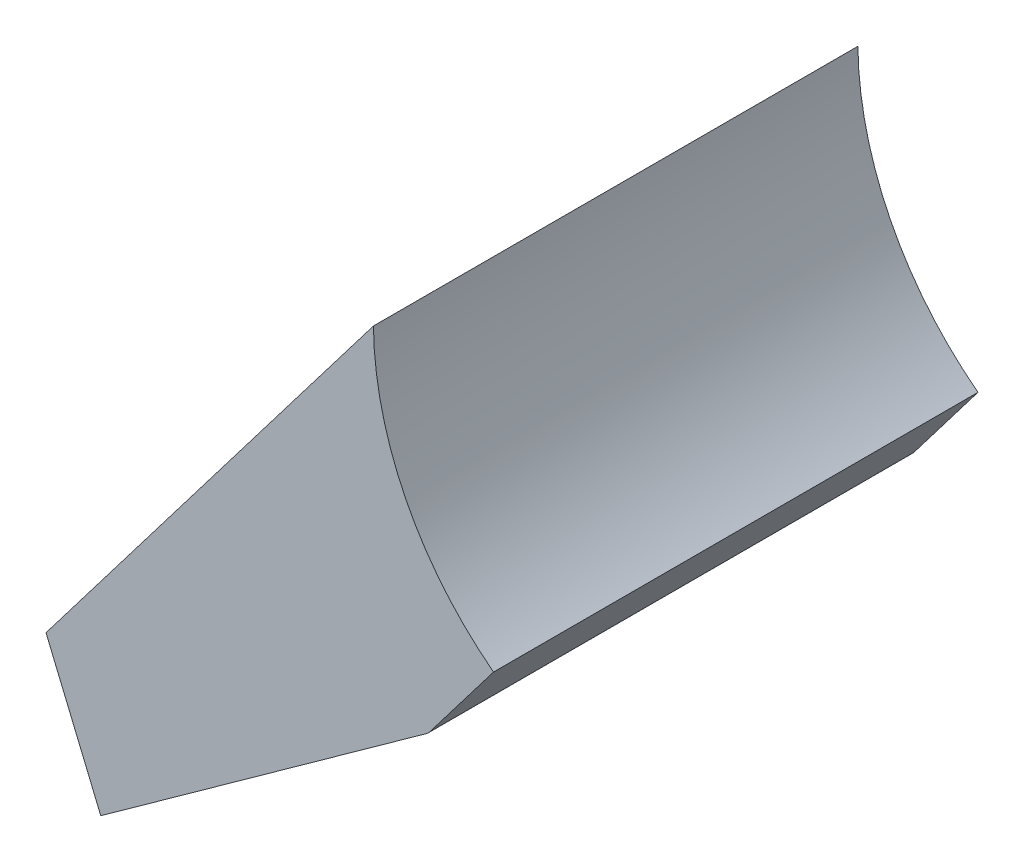
ISO-10303-21;
HEADER;
FILE_DESCRIPTION(('STEP AP214'),'2;1');
FILE_NAME('part.step','',(''),(''),'','','');
FILE_SCHEMA(('AUTOMOTIVE_DESIGN { 1 0 10303 214 1 1 1 1 }'));
ENDSEC;
DATA;
#1=APPLICATION_CONTEXT('core data for automotive mechanical design processes');
#2=APPLICATION_PROTOCOL_DEFINITION('international standard','automotive_design',2000,#1);
#3=PRODUCT_CONTEXT('',#1,'mechanical');
#4=PRODUCT('Part','Part','',(#3));
#5=PRODUCT_RELATED_PRODUCT_CATEGORY('part','',(#4));
#6=PRODUCT_DEFINITION_FORMATION('','',#4);
#7=PRODUCT_DEFINITION_CONTEXT('part definition',#1,'design');
#8=PRODUCT_DEFINITION('design','',#6,#7);
#9=PRODUCT_DEFINITION_SHAPE('','',#8);
#10=(LENGTH_UNIT() NAMED_UNIT(*) SI_UNIT(.MILLI.,.METRE.));
#11=(NAMED_UNIT(*) PLANE_ANGLE_UNIT() SI_UNIT($,.RADIAN.));
#12=(NAMED_UNIT(*) SI_UNIT($,.STERADIAN.) SOLID_ANGLE_UNIT());
#13=UNCERTAINTY_MEASURE_WITH_UNIT(LENGTH_MEASURE(1.E-05),#10,'distance_accuracy_value','');
#14=(GEOMETRIC_REPRESENTATION_CONTEXT(3) GLOBAL_UNCERTAINTY_ASSIGNED_CONTEXT((#13)) GLOBAL_UNIT_ASSIGNED_CONTEXT((#10,
#11,#12)) REPRESENTATION_CONTEXT('',''));
#15=CARTESIAN_POINT('',(0.,0.,0.));
#16=DIRECTION('',(0.,0.,1.));
#17=DIRECTION('',(1.,0.,0.));
#18=AXIS2_PLACEMENT_3D('',#15,#16,#17);
#19=CARTESIAN_POINT('',(-179.782652787691,3339.06473590883,750.));
#20=DIRECTION('',(0.,0.,1.));
#21=DIRECTION('',(1.,0.,0.));
#22=AXIS2_PLACEMENT_3D('',#19,#20,#21);
#23=CYLINDRICAL_SURFACE('',#22,944.883162175554);
#24=CARTESIAN_POINT('',(-179.782652787691,3339.06473590883,1500.));
#25=DIRECTION('',(0.,0.,-1.));
#26=DIRECTION('',(1.,0.,0.));
#27=AXIS2_PLACEMENT_3D('',#24,#25,#26);
#28=CIRCLE('',#27,944.883162175554);
#29=CARTESIAN_POINT('',(-752.762970367689,2587.73408577615,1500.));
#30=VERTEX_POINT('',#29);
#31=CARTESIAN_POINT('',(-1124.61981051138,3329.74081251331,1500.));
#32=VERTEX_POINT('',#31);
#33=EDGE_CURVE('E10',#30,#32,#28,.T.);
#34=ORIENTED_EDGE('',*,*,#33,.F.);
#35=DIRECTION('',(0.,0.,1.));
#36=VECTOR('',#35,1.);
#37=CARTESIAN_POINT('',(-752.76297036769,2587.73408577615,750.));
#38=LINE('',#37,#36);
#39=CARTESIAN_POINT('',(-752.762970367689,2587.73408577615,0.));
#40=VERTEX_POINT('',#39);
#41=EDGE_CURVE('E27',#40,#30,#38,.T.);
#42=ORIENTED_EDGE('',*,*,#41,.F.);
#43=CARTESIAN_POINT('',(-179.782652787691,3339.06473590883,0.));
#44=DIRECTION('',(0.,0.,-1.));
#45=DIRECTION('',(1.,0.,0.));
#46=AXIS2_PLACEMENT_3D('',#43,#44,#45);
#47=CIRCLE('',#46,944.883162175554);
#48=CARTESIAN_POINT('',(-1124.61981051138,3329.74081251331,0.));
#49=VERTEX_POINT('',#48);
#50=EDGE_CURVE('E106',#40,#49,#47,.T.);
#51=ORIENTED_EDGE('',*,*,#50,.T.);
#52=DIRECTION('',(0.,0.,1.));
#53=VECTOR('',#52,1.);
#54=CARTESIAN_POINT('',(-1124.61981051138,3329.74081251331,750.));
#55=LINE('',#54,#53);
#56=EDGE_CURVE('E36',#49,#32,#55,.T.);
#57=ORIENTED_EDGE('',*,*,#56,.T.);
#58=EDGE_LOOP('',(#34,#42,#51,#57));
#59=FACE_BOUND('',#58,.T.);
#60=ADVANCED_FACE('F16',(#59),#23,.F.);
#61=CARTESIAN_POINT('',(-1124.61981051138,3329.74081251331,0.));
#62=DIRECTION('',(-0.795157200603273,0.606403352834371,0.));
#63=DIRECTION('',(-0.606403352834371,-0.795157200603273,0.));
#64=AXIS2_PLACEMENT_3D('',#61,#62,#63);
#65=PLANE('',#64);
#66=DIRECTION('',(-0.606403352834371,-0.795157200603273,0.));
#67=VECTOR('',#66,1.);
#68=CARTESIAN_POINT('',(-1631.50762757375,2665.07513124472,1500.));
#69=LINE('',#68,#67);
#70=CARTESIAN_POINT('',(-2138.39544463612,2000.40944997612,1500.));
#71=VERTEX_POINT('',#70);
#72=EDGE_CURVE('E124',#32,#71,#69,.T.);
#73=ORIENTED_EDGE('',*,*,#72,.F.);
#74=ORIENTED_EDGE('',*,*,#56,.F.);
#75=DIRECTION('',(-0.606403352834371,-0.795157200603273,0.));
#76=VECTOR('',#75,1.);
#77=CARTESIAN_POINT('',(-1631.50762757375,2665.07513124472,0.));
#78=LINE('',#77,#76);
#79=CARTESIAN_POINT('',(-2138.39544463612,2000.40944997612,0.));
#80=VERTEX_POINT('',#79);
#81=EDGE_CURVE('E115',#49,#80,#78,.T.);
#82=ORIENTED_EDGE('',*,*,#81,.T.);
#83=DIRECTION('',(0.,0.,1.));
#84=VECTOR('',#83,1.);
#85=CARTESIAN_POINT('',(-2138.39544463612,2000.40944997612,750.));
#86=LINE('',#85,#84);
#87=EDGE_CURVE('E112',#80,#71,#86,.T.);
#88=ORIENTED_EDGE('',*,*,#87,.T.);
#89=EDGE_LOOP('',(#73,#74,#82,#88));
#90=FACE_BOUND('',#89,.T.);
#91=ADVANCED_FACE('F140',(#90),#65,.T.);
#92=CARTESIAN_POINT('',(-2138.39544463612,2000.40944997612,0.));
#93=DIRECTION('',(-0.92273930879626,-0.385424659307367,0.));
#94=DIRECTION('',(0.385424659307367,-0.92273930879626,0.));
#95=AXIS2_PLACEMENT_3D('',#92,#93,#94);
#96=PLANE('',#95);
#97=DIRECTION('',(0.385424659307367,-0.92273930879626,0.));
#98=VECTOR('',#97,1.);
#99=CARTESIAN_POINT('',(-2053.6020195885,1797.40680204095,1500.));
#100=LINE('',#99,#98);
#101=CARTESIAN_POINT('',(-1968.80859454088,1594.40415410577,1500.));
#102=VERTEX_POINT('',#101);
#103=EDGE_CURVE('E87',#71,#102,#100,.T.);
#104=ORIENTED_EDGE('',*,*,#103,.F.);
#105=ORIENTED_EDGE('',*,*,#87,.F.);
#106=DIRECTION('',(0.385424659307367,-0.92273930879626,0.));
#107=VECTOR('',#106,1.);
#108=CARTESIAN_POINT('',(-2053.6020195885,1797.40680204095,0.));
#109=LINE('',#108,#107);
#110=CARTESIAN_POINT('',(-1968.80859454088,1594.40415410577,0.));
#111=VERTEX_POINT('',#110);
#112=EDGE_CURVE('E100',#80,#111,#109,.T.);
#113=ORIENTED_EDGE('',*,*,#112,.T.);
#114=DIRECTION('',(0.,0.,1.));
#115=VECTOR('',#114,1.);
#116=CARTESIAN_POINT('',(-1968.80859454088,1594.40415410577,750.));
#117=LINE('',#116,#115);
#118=EDGE_CURVE('E89',#111,#102,#117,.T.);
#119=ORIENTED_EDGE('',*,*,#118,.T.);
#120=EDGE_LOOP('',(#104,#105,#113,#119));
#121=FACE_BOUND('',#120,.T.);
#122=ADVANCED_FACE('F145',(#121),#96,.T.);
#123=CARTESIAN_POINT('',(-954.829633856681,2322.77057308424,0.));
#124=DIRECTION('',(0.795157200603272,-0.606403352834372,0.));
#125=DIRECTION('',(0.606403352834372,0.795157200603272,0.));
#126=AXIS2_PLACEMENT_3D('',#123,#124,#125);
#127=PLANE('',#126);
#128=DIRECTION('',(0.,0.,1.));
#129=VECTOR('',#128,1.);
#130=CARTESIAN_POINT('',(-950.303806436218,2328.70514492532,750.));
#131=LINE('',#130,#129);
#132=CARTESIAN_POINT('',(-950.303806436218,2328.70514492532,0.));
#133=VERTEX_POINT('',#132);
#134=CARTESIAN_POINT('',(-950.303806436218,2328.70514492532,1500.));
#135=VERTEX_POINT('',#134);
#136=EDGE_CURVE('E94',#133,#135,#131,.T.);
#137=ORIENTED_EDGE('',*,*,#136,.F.);
#138=DIRECTION('',(0.606403352834372,0.795157200603272,0.));
#139=VECTOR('',#138,1.);
#140=CARTESIAN_POINT('',(-851.533388401954,2458.21961535074,0.));
#141=LINE('',#140,#139);
#142=EDGE_CURVE('E90',#133,#40,#141,.T.);
#143=ORIENTED_EDGE('',*,*,#142,.T.);
#144=ORIENTED_EDGE('',*,*,#41,.T.);
#145=DIRECTION('',(0.606403352834372,0.795157200603272,0.));
#146=VECTOR('',#145,1.);
#147=CARTESIAN_POINT('',(-851.533388401954,2458.21961535074,1500.));
#148=LINE('',#147,#146);
#149=EDGE_CURVE('E107',#135,#30,#148,.T.);
#150=ORIENTED_EDGE('',*,*,#149,.F.);
#151=EDGE_LOOP('',(#137,#143,#144,#150));
#152=FACE_BOUND('',#151,.T.);
#153=ADVANCED_FACE('F147',(#152),#127,.T.);
#154=CARTESIAN_POINT('',(-1968.80859454088,1594.40415410577,0.));
#155=DIRECTION('',(0.583408417370356,-0.812178932589006,0.));
#156=DIRECTION('',(0.812178932589006,0.583408417370356,0.));
#157=AXIS2_PLACEMENT_3D('',#154,#155,#156);
#158=PLANE('',#157);
#159=DIRECTION('',(0.,0.,1.));
#160=VECTOR('',#159,1.);
#161=CARTESIAN_POINT('',(-960.891245597864,2318.41636593759,750.));
#162=LINE('',#161,#160);
#163=CARTESIAN_POINT('',(-960.891245597864,2318.41636593759,0.));
#164=VERTEX_POINT('',#163);
#165=CARTESIAN_POINT('',(-960.891245597864,2318.41636593759,1500.));
#166=VERTEX_POINT('',#165);
#167=EDGE_CURVE('E67',#164,#166,#162,.T.);
#168=ORIENTED_EDGE('',*,*,#167,.T.);
#169=DIRECTION('',(0.812178932589006,0.583408417370356,0.));
#170=VECTOR('',#169,1.);
#171=CARTESIAN_POINT('',(-1464.84992006937,1956.41026002168,1500.));
#172=LINE('',#171,#170);
#173=EDGE_CURVE('E74',#102,#166,#172,.T.);
#174=ORIENTED_EDGE('',*,*,#173,.F.);
#175=ORIENTED_EDGE('',*,*,#118,.F.);
#176=DIRECTION('',(0.812178932589006,0.583408417370356,0.));
#177=VECTOR('',#176,1.);
#178=CARTESIAN_POINT('',(-1464.84992006937,1956.41026002168,0.));
#179=LINE('',#178,#177);
#180=EDGE_CURVE('E76',#111,#164,#179,.T.);
#181=ORIENTED_EDGE('',*,*,#180,.T.);
#182=EDGE_LOOP('',(#168,#174,#175,#181));
#183=FACE_BOUND('',#182,.T.);
#184=ADVANCED_FACE('F72',(#183),#158,.T.);
#185=CARTESIAN_POINT('',(0.,0.,0.));
#186=DIRECTION('',(0.,0.,1.));
#187=DIRECTION('',(1.,0.,0.));
#188=AXIS2_PLACEMENT_3D('',#185,#186,#187);
#189=PLANE('',#188);
#190=ORIENTED_EDGE('',*,*,#142,.F.);
#191=CARTESIAN_POINT('',(-990.061666466382,2359.02531256704,0.));
#192=DIRECTION('',(0.,0.,1.));
#193=DIRECTION('',(1.,0.,0.));
#194=AXIS2_PLACEMENT_3D('',#191,#192,#193);
#195=CIRCLE('',#194,49.9999999999999);
#196=EDGE_CURVE('E96',#164,#133,#195,.T.);
#197=ORIENTED_EDGE('',*,*,#196,.F.);
#198=ORIENTED_EDGE('',*,*,#180,.F.);
#199=ORIENTED_EDGE('',*,*,#112,.F.);
#200=ORIENTED_EDGE('',*,*,#81,.F.);
#201=ORIENTED_EDGE('',*,*,#50,.F.);
#202=EDGE_LOOP('',(#190,#197,#198,#199,#200,#201));
#203=FACE_BOUND('',#202,.T.);
#204=ADVANCED_FACE('F143',(#203),#189,.F.);
#205=CARTESIAN_POINT('',(0.,0.,1500.));
#206=DIRECTION('',(0.,0.,1.));
#207=DIRECTION('',(1.,0.,0.));
#208=AXIS2_PLACEMENT_3D('',#205,#206,#207);
#209=PLANE('',#208);
#210=CARTESIAN_POINT('',(-990.061666466382,2359.02531256704,1500.));
#211=DIRECTION('',(0.,0.,-1.));
#212=DIRECTION('',(1.,0.,0.));
#213=AXIS2_PLACEMENT_3D('',#210,#211,#212);
#214=CIRCLE('',#213,49.9999999999999);
#215=EDGE_CURVE('E20',#135,#166,#214,.T.);
#216=ORIENTED_EDGE('',*,*,#215,.F.);
#217=ORIENTED_EDGE('',*,*,#149,.T.);
#218=ORIENTED_EDGE('',*,*,#33,.T.);
#219=ORIENTED_EDGE('',*,*,#72,.T.);
#220=ORIENTED_EDGE('',*,*,#103,.T.);
#221=ORIENTED_EDGE('',*,*,#173,.T.);
#222=EDGE_LOOP('',(#216,#217,#218,#219,#220,#221));
#223=FACE_BOUND('',#222,.T.);
#224=ADVANCED_FACE('F83',(#223),#209,.T.);
#225=CARTESIAN_POINT('',(-990.061666466382,2359.02531256704,749.999999999999));
#226=DIRECTION('',(0.,0.,1.));
#227=DIRECTION('',(1.,0.,0.));
#228=AXIS2_PLACEMENT_3D('',#225,#226,#227);
#229=CYLINDRICAL_SURFACE('',#228,49.9999999999999);
#230=ORIENTED_EDGE('',*,*,#136,.T.);
#231=ORIENTED_EDGE('',*,*,#215,.T.);
#232=ORIENTED_EDGE('',*,*,#167,.F.);
#233=ORIENTED_EDGE('',*,*,#196,.T.);
#234=EDGE_LOOP('',(#230,#231,#232,#233));
#235=FACE_BOUND('',#234,.T.);
#236=ADVANCED_FACE('F18',(#235),#229,.T.);
#237=CLOSED_SHELL('',(#60,#91,#122,#153,#184,#204,#224,#236));
#238=MANIFOLD_SOLID_BREP('B1',#237);
#239=ADVANCED_BREP_SHAPE_REPRESENTATION('',(#18,#238),#14);
#240=SHAPE_DEFINITION_REPRESENTATION(#9,#239);
ENDSEC;
END-ISO-10303-21;
